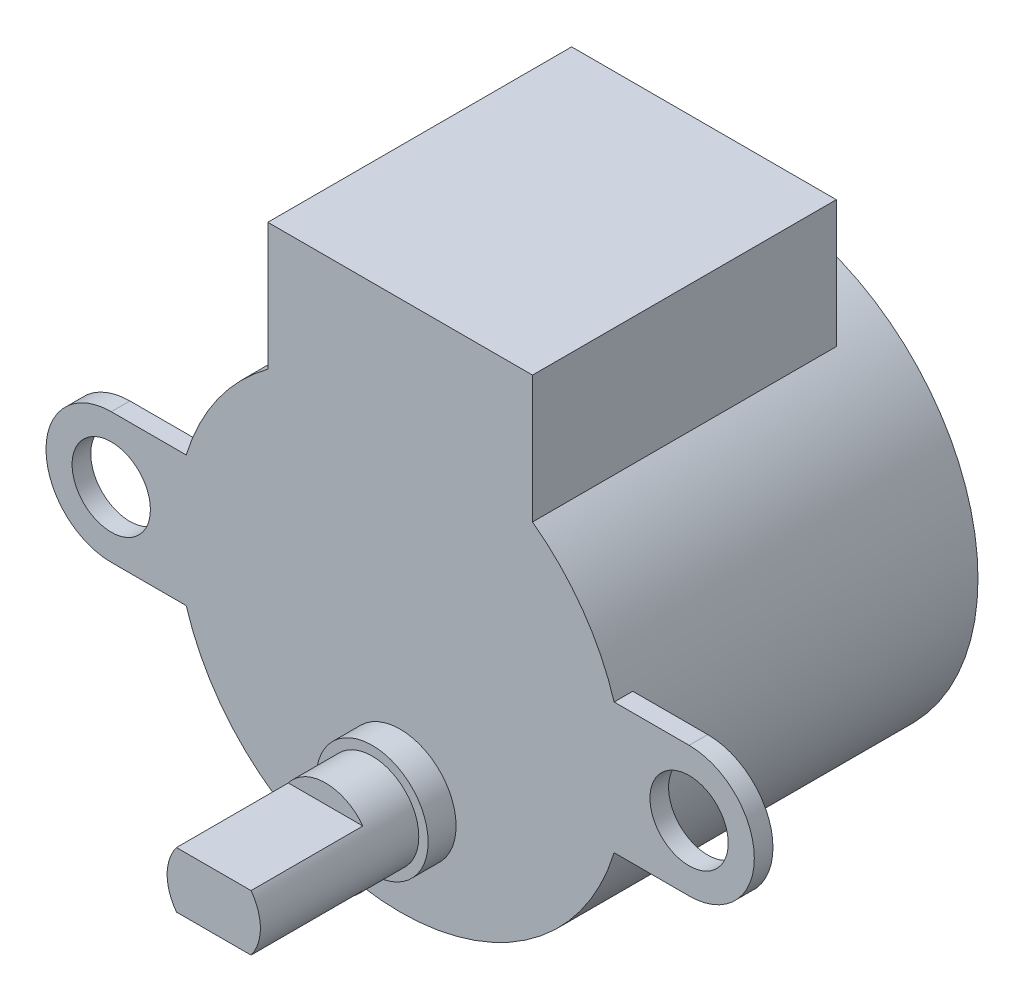
ISO-10303-21;
HEADER;
FILE_DESCRIPTION(('STEP AP214'),'2;1');
FILE_NAME('part.step','',(''),(''),'','','');
FILE_SCHEMA(('AUTOMOTIVE_DESIGN { 1 0 10303 214 1 1 1 1 }'));
ENDSEC;
DATA;
#1=APPLICATION_CONTEXT('core data for automotive mechanical design processes');
#2=APPLICATION_PROTOCOL_DEFINITION('international standard','automotive_design',2000,#1);
#3=PRODUCT_CONTEXT('',#1,'mechanical');
#4=PRODUCT('Part','Part','',(#3));
#5=PRODUCT_RELATED_PRODUCT_CATEGORY('part','',(#4));
#6=PRODUCT_DEFINITION_FORMATION('','',#4);
#7=PRODUCT_DEFINITION_CONTEXT('part definition',#1,'design');
#8=PRODUCT_DEFINITION('design','',#6,#7);
#9=PRODUCT_DEFINITION_SHAPE('','',#8);
#10=(LENGTH_UNIT() NAMED_UNIT(*) SI_UNIT(.MILLI.,.METRE.));
#11=(NAMED_UNIT(*) PLANE_ANGLE_UNIT() SI_UNIT($,.RADIAN.));
#12=(NAMED_UNIT(*) SI_UNIT($,.STERADIAN.) SOLID_ANGLE_UNIT());
#13=UNCERTAINTY_MEASURE_WITH_UNIT(LENGTH_MEASURE(1.E-05),#10,'distance_accuracy_value','');
#14=(GEOMETRIC_REPRESENTATION_CONTEXT(3) GLOBAL_UNCERTAINTY_ASSIGNED_CONTEXT((#13)) GLOBAL_UNIT_ASSIGNED_CONTEXT((#10,
#11,#12)) REPRESENTATION_CONTEXT('',''));
#15=CARTESIAN_POINT('',(0.,0.,0.));
#16=DIRECTION('',(0.,0.,1.));
#17=DIRECTION('',(1.,0.,0.));
#18=AXIS2_PLACEMENT_3D('',#15,#16,#17);
#19=CARTESIAN_POINT('',(7.1,16.5,19.));
#20=DIRECTION('',(-1.,0.,0.));
#21=DIRECTION('',(0.,-1.,0.));
#22=AXIS2_PLACEMENT_3D('',#19,#20,#21);
#23=PLANE('',#22);
#24=DIRECTION('',(0.,-1.,0.));
#25=VECTOR('',#24,1.);
#26=CARTESIAN_POINT('',(7.1,9.67419247275968,2.7));
#27=LINE('',#26,#25);
#28=CARTESIAN_POINT('',(7.1,16.5,2.7));
#29=VERTEX_POINT('',#28);
#30=CARTESIAN_POINT('',(7.1,9.67419247275968,2.7));
#31=VERTEX_POINT('',#30);
#32=EDGE_CURVE('E267',#29,#31,#27,.T.);
#33=ORIENTED_EDGE('',*,*,#32,.F.);
#34=DIRECTION('',(0.,0.,-1.));
#35=VECTOR('',#34,1.);
#36=CARTESIAN_POINT('',(7.1,16.5,19.));
#37=LINE('',#36,#35);
#38=CARTESIAN_POINT('',(7.1,16.5,19.));
#39=VERTEX_POINT('',#38);
#40=EDGE_CURVE('E289',#39,#29,#37,.T.);
#41=ORIENTED_EDGE('',*,*,#40,.F.);
#42=DIRECTION('',(0.,1.,0.));
#43=VECTOR('',#42,1.);
#44=CARTESIAN_POINT('',(7.1,16.5,19.));
#45=LINE('',#44,#43);
#46=CARTESIAN_POINT('',(7.1,9.67419247275968,19.));
#47=VERTEX_POINT('',#46);
#48=EDGE_CURVE('E274',#47,#39,#45,.T.);
#49=ORIENTED_EDGE('',*,*,#48,.F.);
#50=DIRECTION('',(0.,0.,-1.));
#51=VECTOR('',#50,1.);
#52=CARTESIAN_POINT('',(7.1,9.67419247275968,19.));
#53=LINE('',#52,#51);
#54=EDGE_CURVE('E38',#47,#31,#53,.T.);
#55=ORIENTED_EDGE('',*,*,#54,.T.);
#56=EDGE_LOOP('',(#33,#41,#49,#55));
#57=FACE_BOUND('',#56,.T.);
#58=ADVANCED_FACE('F34',(#57),#23,.F.);
#59=CARTESIAN_POINT('',(-7.1,16.5,19.));
#60=DIRECTION('',(0.,-1.,0.));
#61=DIRECTION('',(0.,0.,-1.));
#62=AXIS2_PLACEMENT_3D('',#59,#60,#61);
#63=PLANE('',#62);
#64=DIRECTION('',(1.,0.,0.));
#65=VECTOR('',#64,1.);
#66=CARTESIAN_POINT('',(7.1,16.5,2.7));
#67=LINE('',#66,#65);
#68=CARTESIAN_POINT('',(-7.1,16.5,2.7));
#69=VERTEX_POINT('',#68);
#70=EDGE_CURVE('E265',#69,#29,#67,.T.);
#71=ORIENTED_EDGE('',*,*,#70,.F.);
#72=DIRECTION('',(0.,0.,-1.));
#73=VECTOR('',#72,1.);
#74=CARTESIAN_POINT('',(-7.1,16.5,19.));
#75=LINE('',#74,#73);
#76=CARTESIAN_POINT('',(-7.1,16.5,19.));
#77=VERTEX_POINT('',#76);
#78=EDGE_CURVE('E287',#77,#69,#75,.T.);
#79=ORIENTED_EDGE('',*,*,#78,.F.);
#80=DIRECTION('',(-1.,0.,0.));
#81=VECTOR('',#80,1.);
#82=CARTESIAN_POINT('',(-7.1,16.5,19.));
#83=LINE('',#82,#81);
#84=EDGE_CURVE('E278',#39,#77,#83,.T.);
#85=ORIENTED_EDGE('',*,*,#84,.F.);
#86=ORIENTED_EDGE('',*,*,#40,.T.);
#87=EDGE_LOOP('',(#71,#79,#85,#86));
#88=FACE_BOUND('',#87,.T.);
#89=ADVANCED_FACE('F309',(#88),#63,.F.);
#90=CARTESIAN_POINT('',(-7.1,9.67419247275967,19.));
#91=DIRECTION('',(1.,0.,0.));
#92=DIRECTION('',(0.,1.,0.));
#93=AXIS2_PLACEMENT_3D('',#90,#91,#92);
#94=PLANE('',#93);
#95=DIRECTION('',(0.,1.,0.));
#96=VECTOR('',#95,1.);
#97=CARTESIAN_POINT('',(-7.1,16.5,2.7));
#98=LINE('',#97,#96);
#99=CARTESIAN_POINT('',(-7.1,9.67419247275967,2.7));
#100=VERTEX_POINT('',#99);
#101=EDGE_CURVE('E263',#100,#69,#98,.T.);
#102=ORIENTED_EDGE('',*,*,#101,.F.);
#103=DIRECTION('',(0.,0.,-1.));
#104=VECTOR('',#103,1.);
#105=CARTESIAN_POINT('',(-7.1,9.67419247275967,19.));
#106=LINE('',#105,#104);
#107=CARTESIAN_POINT('',(-7.1,9.67419247275967,19.));
#108=VERTEX_POINT('',#107);
#109=EDGE_CURVE('E282',#108,#100,#106,.T.);
#110=ORIENTED_EDGE('',*,*,#109,.F.);
#111=DIRECTION('',(0.,-1.,0.));
#112=VECTOR('',#111,1.);
#113=CARTESIAN_POINT('',(-7.1,9.67419247275967,19.));
#114=LINE('',#113,#112);
#115=EDGE_CURVE('E280',#77,#108,#114,.T.);
#116=ORIENTED_EDGE('',*,*,#115,.F.);
#117=ORIENTED_EDGE('',*,*,#78,.T.);
#118=EDGE_LOOP('',(#102,#110,#116,#117));
#119=FACE_BOUND('',#118,.T.);
#120=ADVANCED_FACE('F312',(#119),#94,.F.);
#121=CARTESIAN_POINT('',(0.,0.,19.));
#122=DIRECTION('',(0.,0.,-1.));
#123=DIRECTION('',(-1.,0.,0.));
#124=AXIS2_PLACEMENT_3D('',#121,#122,#123);
#125=CYLINDRICAL_SURFACE('',#124,12.);
#126=CARTESIAN_POINT('',(0.,0.,0.));
#127=DIRECTION('',(0.,0.,1.));
#128=DIRECTION('',(1.,0.,0.));
#129=AXIS2_PLACEMENT_3D('',#126,#127,#128);
#130=CIRCLE('',#129,12.);
#131=CARTESIAN_POINT('',(12.,0.,0.));
#132=VERTEX_POINT('',#131);
#133=EDGE_CURVE('E270',#132,#132,#130,.T.);
#134=ORIENTED_EDGE('',*,*,#133,.T.);
#135=EDGE_LOOP('',(#134));
#136=FACE_BOUND('',#135,.T.);
#137=CARTESIAN_POINT('',(0.,0.,18.));
#138=DIRECTION('',(0.,0.,-1.));
#139=DIRECTION('',(1.,0.,0.));
#140=AXIS2_PLACEMENT_3D('',#137,#138,#139);
#141=CIRCLE('',#140,12.);
#142=CARTESIAN_POINT('',(11.478240283249,3.49999999999999,18.));
#143=VERTEX_POINT('',#142);
#144=CARTESIAN_POINT('',(11.478240283249,-3.5,18.));
#145=VERTEX_POINT('',#144);
#146=EDGE_CURVE('E203',#143,#145,#141,.T.);
#147=ORIENTED_EDGE('',*,*,#146,.T.);
#148=DIRECTION('',(0.,0.,1.));
#149=VECTOR('',#148,1.);
#150=CARTESIAN_POINT('',(11.478240283249,-3.5,18.));
#151=LINE('',#150,#149);
#152=CARTESIAN_POINT('',(11.478240283249,-3.5,19.));
#153=VERTEX_POINT('',#152);
#154=EDGE_CURVE('E219',#145,#153,#151,.T.);
#155=ORIENTED_EDGE('',*,*,#154,.T.);
#156=CARTESIAN_POINT('',(0.,0.,19.));
#157=DIRECTION('',(0.,0.,1.));
#158=DIRECTION('',(1.,0.,0.));
#159=AXIS2_PLACEMENT_3D('',#156,#157,#158);
#160=CIRCLE('',#159,12.);
#161=CARTESIAN_POINT('',(-11.478240283249,-3.5,19.));
#162=VERTEX_POINT('',#161);
#163=EDGE_CURVE('E275',#162,#153,#160,.T.);
#164=ORIENTED_EDGE('',*,*,#163,.F.);
#165=DIRECTION('',(0.,0.,1.));
#166=VECTOR('',#165,1.);
#167=CARTESIAN_POINT('',(-11.478240283249,-3.49999999999999,18.));
#168=LINE('',#167,#166);
#169=CARTESIAN_POINT('',(-11.478240283249,-3.49999999999999,18.));
#170=VERTEX_POINT('',#169);
#171=EDGE_CURVE('E258',#170,#162,#168,.T.);
#172=ORIENTED_EDGE('',*,*,#171,.F.);
#173=CARTESIAN_POINT('',(0.,0.,18.));
#174=DIRECTION('',(0.,0.,-1.));
#175=DIRECTION('',(1.,0.,0.));
#176=AXIS2_PLACEMENT_3D('',#173,#174,#175);
#177=CIRCLE('',#176,12.);
#178=CARTESIAN_POINT('',(-11.478240283249,3.49999999999999,18.));
#179=VERTEX_POINT('',#178);
#180=EDGE_CURVE('E239',#170,#179,#177,.T.);
#181=ORIENTED_EDGE('',*,*,#180,.T.);
#182=DIRECTION('',(0.,0.,1.));
#183=VECTOR('',#182,1.);
#184=CARTESIAN_POINT('',(-11.478240283249,3.49999999999999,18.));
#185=LINE('',#184,#183);
#186=CARTESIAN_POINT('',(-11.478240283249,3.49999999999999,19.));
#187=VERTEX_POINT('',#186);
#188=EDGE_CURVE('E255',#179,#187,#185,.T.);
#189=ORIENTED_EDGE('',*,*,#188,.T.);
#190=EDGE_CURVE('E271',#108,#187,#160,.T.);
#191=ORIENTED_EDGE('',*,*,#190,.F.);
#192=ORIENTED_EDGE('',*,*,#109,.T.);
#193=CARTESIAN_POINT('',(0.,0.,2.7));
#194=DIRECTION('',(0.,0.,1.));
#195=DIRECTION('',(-1.,0.,0.));
#196=AXIS2_PLACEMENT_3D('',#193,#194,#195);
#197=CIRCLE('',#196,12.);
#198=EDGE_CURVE('E254',#31,#100,#197,.T.);
#199=ORIENTED_EDGE('',*,*,#198,.F.);
#200=ORIENTED_EDGE('',*,*,#54,.F.);
#201=CARTESIAN_POINT('',(11.478240283249,3.49999999999999,19.));
#202=VERTEX_POINT('',#201);
#203=EDGE_CURVE('E276',#202,#47,#160,.T.);
#204=ORIENTED_EDGE('',*,*,#203,.F.);
#205=DIRECTION('',(0.,0.,1.));
#206=VECTOR('',#205,1.);
#207=CARTESIAN_POINT('',(11.478240283249,3.49999999999999,18.));
#208=LINE('',#207,#206);
#209=EDGE_CURVE('E222',#143,#202,#208,.T.);
#210=ORIENTED_EDGE('',*,*,#209,.F.);
#211=EDGE_LOOP('',(#147,#155,#164,#172,#181,#189,#191,#192,#199,#200,#204,#210));
#212=FACE_BOUND('',#211,.T.);
#213=ADVANCED_FACE('F36',(#136,#212),#125,.T.);
#214=CARTESIAN_POINT('',(0.,0.,19.));
#215=DIRECTION('',(0.,0.,1.));
#216=DIRECTION('',(1.,0.,0.));
#217=AXIS2_PLACEMENT_3D('',#214,#215,#216);
#218=PLANE('',#217);
#219=CARTESIAN_POINT('',(0.,-6.5,19.));
#220=DIRECTION('',(0.,0.,1.));
#221=DIRECTION('',(1.,0.,0.));
#222=AXIS2_PLACEMENT_3D('',#219,#220,#221);
#223=CIRCLE('',#222,3.);
#224=CARTESIAN_POINT('',(3.,-6.5,19.));
#225=VERTEX_POINT('',#224);
#226=EDGE_CURVE('E187',#225,#225,#223,.T.);
#227=ORIENTED_EDGE('',*,*,#226,.F.);
#228=EDGE_LOOP('',(#227));
#229=FACE_BOUND('',#228,.T.);
#230=ORIENTED_EDGE('',*,*,#190,.T.);
#231=DIRECTION('',(-1.,0.,0.));
#232=VECTOR('',#231,1.);
#233=CARTESIAN_POINT('',(-15.5,3.5,19.));
#234=LINE('',#233,#232);
#235=CARTESIAN_POINT('',(-15.5,3.5,19.));
#236=VERTEX_POINT('',#235);
#237=EDGE_CURVE('E236',#187,#236,#234,.T.);
#238=ORIENTED_EDGE('',*,*,#237,.T.);
#239=CARTESIAN_POINT('',(-15.5,0.,19.));
#240=DIRECTION('',(0.,0.,1.));
#241=DIRECTION('',(1.,0.,0.));
#242=AXIS2_PLACEMENT_3D('',#239,#240,#241);
#243=CIRCLE('',#242,3.5);
#244=CARTESIAN_POINT('',(-15.5,-3.5,19.));
#245=VERTEX_POINT('',#244);
#246=EDGE_CURVE('E229',#236,#245,#243,.T.);
#247=ORIENTED_EDGE('',*,*,#246,.T.);
#248=DIRECTION('',(1.,0.,0.));
#249=VECTOR('',#248,1.);
#250=CARTESIAN_POINT('',(-15.5,-3.5,19.));
#251=LINE('',#250,#249);
#252=EDGE_CURVE('E248',#245,#162,#251,.T.);
#253=ORIENTED_EDGE('',*,*,#252,.T.);
#254=ORIENTED_EDGE('',*,*,#163,.T.);
#255=DIRECTION('',(1.,0.,0.));
#256=VECTOR('',#255,1.);
#257=CARTESIAN_POINT('',(11.478240283249,-3.49999999999999,19.));
#258=LINE('',#257,#256);
#259=CARTESIAN_POINT('',(15.5,-3.5,19.));
#260=VERTEX_POINT('',#259);
#261=EDGE_CURVE('E200',#153,#260,#258,.T.);
#262=ORIENTED_EDGE('',*,*,#261,.T.);
#263=CARTESIAN_POINT('',(15.5,0.,19.));
#264=DIRECTION('',(0.,0.,1.));
#265=DIRECTION('',(1.,0.,0.));
#266=AXIS2_PLACEMENT_3D('',#263,#264,#265);
#267=CIRCLE('',#266,3.5);
#268=CARTESIAN_POINT('',(15.5,3.5,19.));
#269=VERTEX_POINT('',#268);
#270=EDGE_CURVE('E193',#260,#269,#267,.T.);
#271=ORIENTED_EDGE('',*,*,#270,.T.);
#272=DIRECTION('',(-1.,0.,0.));
#273=VECTOR('',#272,1.);
#274=CARTESIAN_POINT('',(11.478240283249,3.49999999999999,19.));
#275=LINE('',#274,#273);
#276=EDGE_CURVE('E212',#269,#202,#275,.T.);
#277=ORIENTED_EDGE('',*,*,#276,.T.);
#278=ORIENTED_EDGE('',*,*,#203,.T.);
#279=ORIENTED_EDGE('',*,*,#48,.T.);
#280=ORIENTED_EDGE('',*,*,#84,.T.);
#281=ORIENTED_EDGE('',*,*,#115,.T.);
#282=EDGE_LOOP('',(#230,#238,#247,#253,#254,#262,#271,#277,#278,#279,#280,#281));
#283=FACE_BOUND('',#282,.T.);
#284=CARTESIAN_POINT('',(-15.5,0.,19.));
#285=DIRECTION('',(0.,0.,1.));
#286=DIRECTION('',(1.,0.,0.));
#287=AXIS2_PLACEMENT_3D('',#284,#285,#286);
#288=CIRCLE('',#287,2.1);
#289=CARTESIAN_POINT('',(-13.4,0.,19.));
#290=VERTEX_POINT('',#289);
#291=EDGE_CURVE('E218',#290,#290,#288,.T.);
#292=ORIENTED_EDGE('',*,*,#291,.F.);
#293=EDGE_LOOP('',(#292));
#294=FACE_BOUND('',#293,.T.);
#295=CARTESIAN_POINT('',(15.5,0.,19.));
#296=DIRECTION('',(0.,0.,1.));
#297=DIRECTION('',(1.,0.,0.));
#298=AXIS2_PLACEMENT_3D('',#295,#296,#297);
#299=CIRCLE('',#298,2.1);
#300=CARTESIAN_POINT('',(17.6,0.,19.));
#301=VERTEX_POINT('',#300);
#302=EDGE_CURVE('E186',#301,#301,#299,.T.);
#303=ORIENTED_EDGE('',*,*,#302,.F.);
#304=EDGE_LOOP('',(#303));
#305=FACE_BOUND('',#304,.T.);
#306=ADVANCED_FACE('F314',(#229,#283,#294,#305),#218,.T.);
#307=CARTESIAN_POINT('',(0.,0.,0.));
#308=DIRECTION('',(0.,0.,1.));
#309=DIRECTION('',(1.,0.,0.));
#310=AXIS2_PLACEMENT_3D('',#307,#308,#309);
#311=PLANE('',#310);
#312=ORIENTED_EDGE('',*,*,#133,.F.);
#313=EDGE_LOOP('',(#312));
#314=FACE_BOUND('',#313,.T.);
#315=ADVANCED_FACE('F352',(#314),#311,.F.);
#316=CARTESIAN_POINT('',(0.,0.,2.7));
#317=DIRECTION('',(0.,0.,-1.));
#318=DIRECTION('',(-1.,0.,0.));
#319=AXIS2_PLACEMENT_3D('',#316,#317,#318);
#320=PLANE('',#319);
#321=ORIENTED_EDGE('',*,*,#198,.T.);
#322=ORIENTED_EDGE('',*,*,#101,.T.);
#323=ORIENTED_EDGE('',*,*,#70,.T.);
#324=ORIENTED_EDGE('',*,*,#32,.T.);
#325=EDGE_LOOP('',(#321,#322,#323,#324));
#326=FACE_BOUND('',#325,.T.);
#327=ADVANCED_FACE('F307',(#326),#320,.T.);
#328=CARTESIAN_POINT('',(-15.5,0.,18.));
#329=DIRECTION('',(0.,0.,1.));
#330=DIRECTION('',(1.,0.,0.));
#331=AXIS2_PLACEMENT_3D('',#328,#329,#330);
#332=CYLINDRICAL_SURFACE('',#331,3.5);
#333=ORIENTED_EDGE('',*,*,#246,.F.);
#334=DIRECTION('',(0.,0.,1.));
#335=VECTOR('',#334,1.);
#336=CARTESIAN_POINT('',(-15.5,3.5,18.));
#337=LINE('',#336,#335);
#338=CARTESIAN_POINT('',(-15.5,3.5,18.));
#339=VERTEX_POINT('',#338);
#340=EDGE_CURVE('E252',#339,#236,#337,.T.);
#341=ORIENTED_EDGE('',*,*,#340,.F.);
#342=CARTESIAN_POINT('',(-15.5,0.,18.));
#343=DIRECTION('',(0.,0.,1.));
#344=DIRECTION('',(1.,0.,0.));
#345=AXIS2_PLACEMENT_3D('',#342,#343,#344);
#346=CIRCLE('',#345,3.5);
#347=CARTESIAN_POINT('',(-15.5,-3.5,18.));
#348=VERTEX_POINT('',#347);
#349=EDGE_CURVE('E232',#339,#348,#346,.T.);
#350=ORIENTED_EDGE('',*,*,#349,.T.);
#351=DIRECTION('',(0.,0.,1.));
#352=VECTOR('',#351,1.);
#353=CARTESIAN_POINT('',(-15.5,-3.5,18.));
#354=LINE('',#353,#352);
#355=EDGE_CURVE('E245',#348,#245,#354,.T.);
#356=ORIENTED_EDGE('',*,*,#355,.T.);
#357=EDGE_LOOP('',(#333,#341,#350,#356));
#358=FACE_BOUND('',#357,.T.);
#359=ADVANCED_FACE('F361',(#358),#332,.T.);
#360=CARTESIAN_POINT('',(-15.5,3.5,18.));
#361=DIRECTION('',(0.,1.,0.));
#362=DIRECTION('',(-1.,0.,0.));
#363=AXIS2_PLACEMENT_3D('',#360,#361,#362);
#364=PLANE('',#363);
#365=ORIENTED_EDGE('',*,*,#237,.F.);
#366=ORIENTED_EDGE('',*,*,#188,.F.);
#367=DIRECTION('',(-1.,0.,0.));
#368=VECTOR('',#367,1.);
#369=CARTESIAN_POINT('',(-15.5,3.5,18.));
#370=LINE('',#369,#368);
#371=EDGE_CURVE('E242',#179,#339,#370,.T.);
#372=ORIENTED_EDGE('',*,*,#371,.T.);
#373=ORIENTED_EDGE('',*,*,#340,.T.);
#374=EDGE_LOOP('',(#365,#366,#372,#373));
#375=FACE_BOUND('',#374,.T.);
#376=ADVANCED_FACE('F364',(#375),#364,.T.);
#377=CARTESIAN_POINT('',(-15.5,-3.5,18.));
#378=DIRECTION('',(0.,-1.,0.));
#379=DIRECTION('',(1.,0.,0.));
#380=AXIS2_PLACEMENT_3D('',#377,#378,#379);
#381=PLANE('',#380);
#382=ORIENTED_EDGE('',*,*,#252,.F.);
#383=ORIENTED_EDGE('',*,*,#355,.F.);
#384=DIRECTION('',(1.,0.,0.));
#385=VECTOR('',#384,1.);
#386=CARTESIAN_POINT('',(-15.5,-3.5,18.));
#387=LINE('',#386,#385);
#388=EDGE_CURVE('E235',#348,#170,#387,.T.);
#389=ORIENTED_EDGE('',*,*,#388,.T.);
#390=ORIENTED_EDGE('',*,*,#171,.T.);
#391=EDGE_LOOP('',(#382,#383,#389,#390));
#392=FACE_BOUND('',#391,.T.);
#393=ADVANCED_FACE('F366',(#392),#381,.T.);
#394=CARTESIAN_POINT('',(-15.5,0.,18.));
#395=DIRECTION('',(0.,0.,1.));
#396=DIRECTION('',(1.,0.,0.));
#397=AXIS2_PLACEMENT_3D('',#394,#395,#396);
#398=PLANE('',#397);
#399=CARTESIAN_POINT('',(-15.5,0.,18.));
#400=DIRECTION('',(0.,0.,1.));
#401=DIRECTION('',(1.,0.,0.));
#402=AXIS2_PLACEMENT_3D('',#399,#400,#401);
#403=CIRCLE('',#402,2.1);
#404=CARTESIAN_POINT('',(-13.4,0.,18.));
#405=VERTEX_POINT('',#404);
#406=EDGE_CURVE('E226',#405,#405,#403,.T.);
#407=ORIENTED_EDGE('',*,*,#406,.T.);
#408=EDGE_LOOP('',(#407));
#409=FACE_BOUND('',#408,.T.);
#410=ORIENTED_EDGE('',*,*,#349,.F.);
#411=ORIENTED_EDGE('',*,*,#371,.F.);
#412=ORIENTED_EDGE('',*,*,#180,.F.);
#413=ORIENTED_EDGE('',*,*,#388,.F.);
#414=EDGE_LOOP('',(#410,#411,#412,#413));
#415=FACE_BOUND('',#414,.T.);
#416=ADVANCED_FACE('F369',(#409,#415),#398,.F.);
#417=CARTESIAN_POINT('',(-15.5,0.,18.));
#418=DIRECTION('',(0.,0.,1.));
#419=DIRECTION('',(1.,0.,0.));
#420=AXIS2_PLACEMENT_3D('',#417,#418,#419);
#421=CYLINDRICAL_SURFACE('',#420,2.1);
#422=ORIENTED_EDGE('',*,*,#406,.F.);
#423=EDGE_LOOP('',(#422));
#424=FACE_BOUND('',#423,.T.);
#425=ORIENTED_EDGE('',*,*,#291,.T.);
#426=EDGE_LOOP('',(#425));
#427=FACE_BOUND('',#426,.T.);
#428=ADVANCED_FACE('F376',(#424,#427),#421,.F.);
#429=CARTESIAN_POINT('',(15.5,0.,18.));
#430=DIRECTION('',(0.,0.,1.));
#431=DIRECTION('',(1.,0.,0.));
#432=AXIS2_PLACEMENT_3D('',#429,#430,#431);
#433=CYLINDRICAL_SURFACE('',#432,3.5);
#434=ORIENTED_EDGE('',*,*,#270,.F.);
#435=DIRECTION('',(0.,0.,1.));
#436=VECTOR('',#435,1.);
#437=CARTESIAN_POINT('',(15.5,-3.5,18.));
#438=LINE('',#437,#436);
#439=CARTESIAN_POINT('',(15.5,-3.5,18.));
#440=VERTEX_POINT('',#439);
#441=EDGE_CURVE('E216',#440,#260,#438,.T.);
#442=ORIENTED_EDGE('',*,*,#441,.F.);
#443=CARTESIAN_POINT('',(15.5,0.,18.));
#444=DIRECTION('',(0.,0.,1.));
#445=DIRECTION('',(1.,0.,0.));
#446=AXIS2_PLACEMENT_3D('',#443,#444,#445);
#447=CIRCLE('',#446,3.5);
#448=CARTESIAN_POINT('',(15.5,3.5,18.));
#449=VERTEX_POINT('',#448);
#450=EDGE_CURVE('E196',#440,#449,#447,.T.);
#451=ORIENTED_EDGE('',*,*,#450,.T.);
#452=DIRECTION('',(0.,0.,1.));
#453=VECTOR('',#452,1.);
#454=CARTESIAN_POINT('',(15.5,3.5,18.));
#455=LINE('',#454,#453);
#456=EDGE_CURVE('E209',#449,#269,#455,.T.);
#457=ORIENTED_EDGE('',*,*,#456,.T.);
#458=EDGE_LOOP('',(#434,#442,#451,#457));
#459=FACE_BOUND('',#458,.T.);
#460=ADVANCED_FACE('F330',(#459),#433,.T.);
#461=CARTESIAN_POINT('',(11.478240283249,-3.49999999999999,18.));
#462=DIRECTION('',(0.,-1.,0.));
#463=DIRECTION('',(1.,0.,0.));
#464=AXIS2_PLACEMENT_3D('',#461,#462,#463);
#465=PLANE('',#464);
#466=ORIENTED_EDGE('',*,*,#261,.F.);
#467=ORIENTED_EDGE('',*,*,#154,.F.);
#468=DIRECTION('',(1.,0.,0.));
#469=VECTOR('',#468,1.);
#470=CARTESIAN_POINT('',(11.478240283249,-3.49999999999999,18.));
#471=LINE('',#470,#469);
#472=EDGE_CURVE('E206',#145,#440,#471,.T.);
#473=ORIENTED_EDGE('',*,*,#472,.T.);
#474=ORIENTED_EDGE('',*,*,#441,.T.);
#475=EDGE_LOOP('',(#466,#467,#473,#474));
#476=FACE_BOUND('',#475,.T.);
#477=ADVANCED_FACE('F323',(#476),#465,.T.);
#478=CARTESIAN_POINT('',(11.478240283249,3.49999999999999,18.));
#479=DIRECTION('',(0.,1.,0.));
#480=DIRECTION('',(-1.,0.,0.));
#481=AXIS2_PLACEMENT_3D('',#478,#479,#480);
#482=PLANE('',#481);
#483=ORIENTED_EDGE('',*,*,#276,.F.);
#484=ORIENTED_EDGE('',*,*,#456,.F.);
#485=DIRECTION('',(-1.,0.,0.));
#486=VECTOR('',#485,1.);
#487=CARTESIAN_POINT('',(11.478240283249,3.49999999999999,18.));
#488=LINE('',#487,#486);
#489=EDGE_CURVE('E199',#449,#143,#488,.T.);
#490=ORIENTED_EDGE('',*,*,#489,.T.);
#491=ORIENTED_EDGE('',*,*,#209,.T.);
#492=EDGE_LOOP('',(#483,#484,#490,#491));
#493=FACE_BOUND('',#492,.T.);
#494=ADVANCED_FACE('F332',(#493),#482,.T.);
#495=CARTESIAN_POINT('',(15.5,0.,18.));
#496=DIRECTION('',(0.,0.,1.));
#497=DIRECTION('',(1.,0.,0.));
#498=AXIS2_PLACEMENT_3D('',#495,#496,#497);
#499=PLANE('',#498);
#500=CARTESIAN_POINT('',(15.5,0.,18.));
#501=DIRECTION('',(0.,0.,1.));
#502=DIRECTION('',(1.,0.,0.));
#503=AXIS2_PLACEMENT_3D('',#500,#501,#502);
#504=CIRCLE('',#503,2.1);
#505=CARTESIAN_POINT('',(17.6,0.,18.));
#506=VERTEX_POINT('',#505);
#507=EDGE_CURVE('E190',#506,#506,#504,.T.);
#508=ORIENTED_EDGE('',*,*,#507,.T.);
#509=EDGE_LOOP('',(#508));
#510=FACE_BOUND('',#509,.T.);
#511=ORIENTED_EDGE('',*,*,#450,.F.);
#512=ORIENTED_EDGE('',*,*,#472,.F.);
#513=ORIENTED_EDGE('',*,*,#146,.F.);
#514=ORIENTED_EDGE('',*,*,#489,.F.);
#515=EDGE_LOOP('',(#511,#512,#513,#514));
#516=FACE_BOUND('',#515,.T.);
#517=ADVANCED_FACE('F326',(#510,#516),#499,.F.);
#518=CARTESIAN_POINT('',(15.5,0.,18.));
#519=DIRECTION('',(0.,0.,1.));
#520=DIRECTION('',(1.,0.,0.));
#521=AXIS2_PLACEMENT_3D('',#518,#519,#520);
#522=CYLINDRICAL_SURFACE('',#521,2.1);
#523=ORIENTED_EDGE('',*,*,#507,.F.);
#524=EDGE_LOOP('',(#523));
#525=FACE_BOUND('',#524,.T.);
#526=ORIENTED_EDGE('',*,*,#302,.T.);
#527=EDGE_LOOP('',(#526));
#528=FACE_BOUND('',#527,.T.);
#529=ADVANCED_FACE('F339',(#525,#528),#522,.F.);
#530=CARTESIAN_POINT('',(0.,-6.5,20.5));
#531=DIRECTION('',(0.,0.,-1.));
#532=DIRECTION('',(-1.,0.,0.));
#533=AXIS2_PLACEMENT_3D('',#530,#531,#532);
#534=CYLINDRICAL_SURFACE('',#533,3.);
#535=CARTESIAN_POINT('',(0.,-6.5,20.5));
#536=DIRECTION('',(0.,0.,1.));
#537=DIRECTION('',(1.,0.,0.));
#538=AXIS2_PLACEMENT_3D('',#535,#536,#537);
#539=CIRCLE('',#538,3.);
#540=CARTESIAN_POINT('',(3.,-6.5,20.5));
#541=VERTEX_POINT('',#540);
#542=EDGE_CURVE('E183',#541,#541,#539,.T.);
#543=ORIENTED_EDGE('',*,*,#542,.F.);
#544=EDGE_LOOP('',(#543));
#545=FACE_BOUND('',#544,.T.);
#546=ORIENTED_EDGE('',*,*,#226,.T.);
#547=EDGE_LOOP('',(#546));
#548=FACE_BOUND('',#547,.T.);
#549=ADVANCED_FACE('F408',(#545,#548),#534,.T.);
#550=CARTESIAN_POINT('',(0.,-6.5,20.5));
#551=DIRECTION('',(0.,0.,1.));
#552=DIRECTION('',(1.,0.,0.));
#553=AXIS2_PLACEMENT_3D('',#550,#551,#552);
#554=PLANE('',#553);
#555=CARTESIAN_POINT('',(0.,-6.5,20.5));
#556=DIRECTION('',(0.,0.,1.));
#557=DIRECTION('',(1.,0.,0.));
#558=AXIS2_PLACEMENT_3D('',#555,#556,#557);
#559=CIRCLE('',#558,2.5);
#560=CARTESIAN_POINT('',(2.5,-6.5,20.5));
#561=VERTEX_POINT('',#560);
#562=EDGE_CURVE('E11',#561,#561,#559,.T.);
#563=ORIENTED_EDGE('',*,*,#562,.F.);
#564=EDGE_LOOP('',(#563));
#565=FACE_BOUND('',#564,.T.);
#566=ORIENTED_EDGE('',*,*,#542,.T.);
#567=EDGE_LOOP('',(#566));
#568=FACE_BOUND('',#567,.T.);
#569=ADVANCED_FACE('F427',(#565,#568),#554,.T.);
#570=CARTESIAN_POINT('',(0.,-6.5,29.));
#571=DIRECTION('',(0.,0.,-1.));
#572=DIRECTION('',(-1.,0.,0.));
#573=AXIS2_PLACEMENT_3D('',#570,#571,#572);
#574=CYLINDRICAL_SURFACE('',#573,2.5);
#575=CARTESIAN_POINT('',(0.,-6.5,29.));
#576=DIRECTION('',(0.,0.,1.));
#577=DIRECTION('',(1.,0.,0.));
#578=AXIS2_PLACEMENT_3D('',#575,#576,#577);
#579=CIRCLE('',#578,2.5);
#580=CARTESIAN_POINT('',(-2.,-5.,29.));
#581=VERTEX_POINT('',#580);
#582=CARTESIAN_POINT('',(-2.,-8.,29.));
#583=VERTEX_POINT('',#582);
#584=EDGE_CURVE('E165',#581,#583,#579,.T.);
#585=ORIENTED_EDGE('',*,*,#584,.F.);
#586=DIRECTION('',(0.,0.,1.));
#587=VECTOR('',#586,1.);
#588=CARTESIAN_POINT('',(-2.,-5.,23.));
#589=LINE('',#588,#587);
#590=CARTESIAN_POINT('',(-2.,-5.,23.));
#591=VERTEX_POINT('',#590);
#592=EDGE_CURVE('E58',#591,#581,#589,.T.);
#593=ORIENTED_EDGE('',*,*,#592,.F.);
#594=CARTESIAN_POINT('',(0.,-6.5,23.));
#595=DIRECTION('',(0.,0.,1.));
#596=DIRECTION('',(1.,0.,0.));
#597=AXIS2_PLACEMENT_3D('',#594,#595,#596);
#598=CIRCLE('',#597,2.5);
#599=CARTESIAN_POINT('',(2.,-5.,23.));
#600=VERTEX_POINT('',#599);
#601=EDGE_CURVE('E150',#600,#591,#598,.T.);
#602=ORIENTED_EDGE('',*,*,#601,.F.);
#603=DIRECTION('',(0.,0.,1.));
#604=VECTOR('',#603,1.);
#605=CARTESIAN_POINT('',(2.,-5.,23.));
#606=LINE('',#605,#604);
#607=CARTESIAN_POINT('',(2.,-5.,29.));
#608=VERTEX_POINT('',#607);
#609=EDGE_CURVE('E158',#600,#608,#606,.T.);
#610=ORIENTED_EDGE('',*,*,#609,.T.);
#611=CARTESIAN_POINT('',(2.,-8.,29.));
#612=VERTEX_POINT('',#611);
#613=EDGE_CURVE('E167',#612,#608,#579,.T.);
#614=ORIENTED_EDGE('',*,*,#613,.F.);
#615=DIRECTION('',(0.,0.,1.));
#616=VECTOR('',#615,1.);
#617=CARTESIAN_POINT('',(2.,-8.,23.));
#618=LINE('',#617,#616);
#619=CARTESIAN_POINT('',(2.,-8.,23.));
#620=VERTEX_POINT('',#619);
#621=EDGE_CURVE('E50',#620,#612,#618,.T.);
#622=ORIENTED_EDGE('',*,*,#621,.F.);
#623=CARTESIAN_POINT('',(0.,-6.5,23.));
#624=DIRECTION('',(0.,0.,1.));
#625=DIRECTION('',(1.,0.,0.));
#626=AXIS2_PLACEMENT_3D('',#623,#624,#625);
#627=CIRCLE('',#626,2.5);
#628=CARTESIAN_POINT('',(-2.,-8.,23.));
#629=VERTEX_POINT('',#628);
#630=EDGE_CURVE('E171',#629,#620,#627,.T.);
#631=ORIENTED_EDGE('',*,*,#630,.F.);
#632=DIRECTION('',(0.,0.,1.));
#633=VECTOR('',#632,1.);
#634=CARTESIAN_POINT('',(-2.,-8.,23.));
#635=LINE('',#634,#633);
#636=EDGE_CURVE('E178',#629,#583,#635,.T.);
#637=ORIENTED_EDGE('',*,*,#636,.T.);
#638=EDGE_LOOP('',(#585,#593,#602,#610,#614,#622,#631,#637));
#639=FACE_BOUND('',#638,.T.);
#640=ORIENTED_EDGE('',*,*,#562,.T.);
#641=EDGE_LOOP('',(#640));
#642=FACE_BOUND('',#641,.T.);
#643=ADVANCED_FACE('F161',(#639,#642),#574,.T.);
#644=CARTESIAN_POINT('',(0.,-6.5,29.));
#645=DIRECTION('',(0.,0.,1.));
#646=DIRECTION('',(1.,0.,0.));
#647=AXIS2_PLACEMENT_3D('',#644,#645,#646);
#648=PLANE('',#647);
#649=DIRECTION('',(1.,0.,0.));
#650=VECTOR('',#649,1.);
#651=CARTESIAN_POINT('',(-2.,-5.,29.));
#652=LINE('',#651,#650);
#653=EDGE_CURVE('E155',#581,#608,#652,.T.);
#654=ORIENTED_EDGE('',*,*,#653,.F.);
#655=ORIENTED_EDGE('',*,*,#584,.T.);
#656=DIRECTION('',(-1.,0.,0.));
#657=VECTOR('',#656,1.);
#658=CARTESIAN_POINT('',(-2.,-8.,29.));
#659=LINE('',#658,#657);
#660=EDGE_CURVE('E174',#612,#583,#659,.T.);
#661=ORIENTED_EDGE('',*,*,#660,.F.);
#662=ORIENTED_EDGE('',*,*,#613,.T.);
#663=EDGE_LOOP('',(#654,#655,#661,#662));
#664=FACE_BOUND('',#663,.T.);
#665=ADVANCED_FACE('F446',(#664),#648,.T.);
#666=CARTESIAN_POINT('',(-2.,-8.,23.));
#667=DIRECTION('',(0.,1.,0.));
#668=DIRECTION('',(0.,0.,1.));
#669=AXIS2_PLACEMENT_3D('',#666,#667,#668);
#670=PLANE('',#669);
#671=ORIENTED_EDGE('',*,*,#660,.T.);
#672=ORIENTED_EDGE('',*,*,#636,.F.);
#673=DIRECTION('',(-1.,0.,0.));
#674=VECTOR('',#673,1.);
#675=CARTESIAN_POINT('',(-2.,-8.,23.));
#676=LINE('',#675,#674);
#677=EDGE_CURVE('E173',#620,#629,#676,.T.);
#678=ORIENTED_EDGE('',*,*,#677,.F.);
#679=ORIENTED_EDGE('',*,*,#621,.T.);
#680=EDGE_LOOP('',(#671,#672,#678,#679));
#681=FACE_BOUND('',#680,.T.);
#682=ADVANCED_FACE('F455',(#681),#670,.F.);
#683=CARTESIAN_POINT('',(0.,-6.5,23.));
#684=DIRECTION('',(0.,0.,1.));
#685=DIRECTION('',(1.,0.,0.));
#686=AXIS2_PLACEMENT_3D('',#683,#684,#685);
#687=PLANE('',#686);
#688=ORIENTED_EDGE('',*,*,#630,.T.);
#689=ORIENTED_EDGE('',*,*,#677,.T.);
#690=EDGE_LOOP('',(#688,#689));
#691=FACE_BOUND('',#690,.T.);
#692=ADVANCED_FACE('F465',(#691),#687,.T.);
#693=CARTESIAN_POINT('',(-2.,-5.,23.));
#694=DIRECTION('',(0.,-1.,0.));
#695=DIRECTION('',(0.,0.,-1.));
#696=AXIS2_PLACEMENT_3D('',#693,#694,#695);
#697=PLANE('',#696);
#698=ORIENTED_EDGE('',*,*,#653,.T.);
#699=ORIENTED_EDGE('',*,*,#609,.F.);
#700=DIRECTION('',(1.,0.,0.));
#701=VECTOR('',#700,1.);
#702=CARTESIAN_POINT('',(-2.,-5.,23.));
#703=LINE('',#702,#701);
#704=EDGE_CURVE('E152',#591,#600,#703,.T.);
#705=ORIENTED_EDGE('',*,*,#704,.F.);
#706=ORIENTED_EDGE('',*,*,#592,.T.);
#707=EDGE_LOOP('',(#698,#699,#705,#706));
#708=FACE_BOUND('',#707,.T.);
#709=ADVANCED_FACE('F157',(#708),#697,.F.);
#710=CARTESIAN_POINT('',(0.,-6.5,23.));
#711=DIRECTION('',(0.,0.,1.));
#712=DIRECTION('',(1.,0.,0.));
#713=AXIS2_PLACEMENT_3D('',#710,#711,#712);
#714=PLANE('',#713);
#715=ORIENTED_EDGE('',*,*,#601,.T.);
#716=ORIENTED_EDGE('',*,*,#704,.T.);
#717=EDGE_LOOP('',(#715,#716));
#718=FACE_BOUND('',#717,.T.);
#719=ADVANCED_FACE('F151',(#718),#714,.T.);
#720=CLOSED_SHELL('',(#58,#89,#120,#213,#306,#315,#327,#359,#376,#393,#416,#428,#460,#477,#494,
#517,#529,#549,#569,#643,#665,#682,#692,#709,#719));
#721=MANIFOLD_SOLID_BREP('B2',#720);
#722=ADVANCED_BREP_SHAPE_REPRESENTATION('',(#18,#721),#14);
#723=SHAPE_DEFINITION_REPRESENTATION(#9,#722);
ENDSEC;
END-ISO-10303-21;
